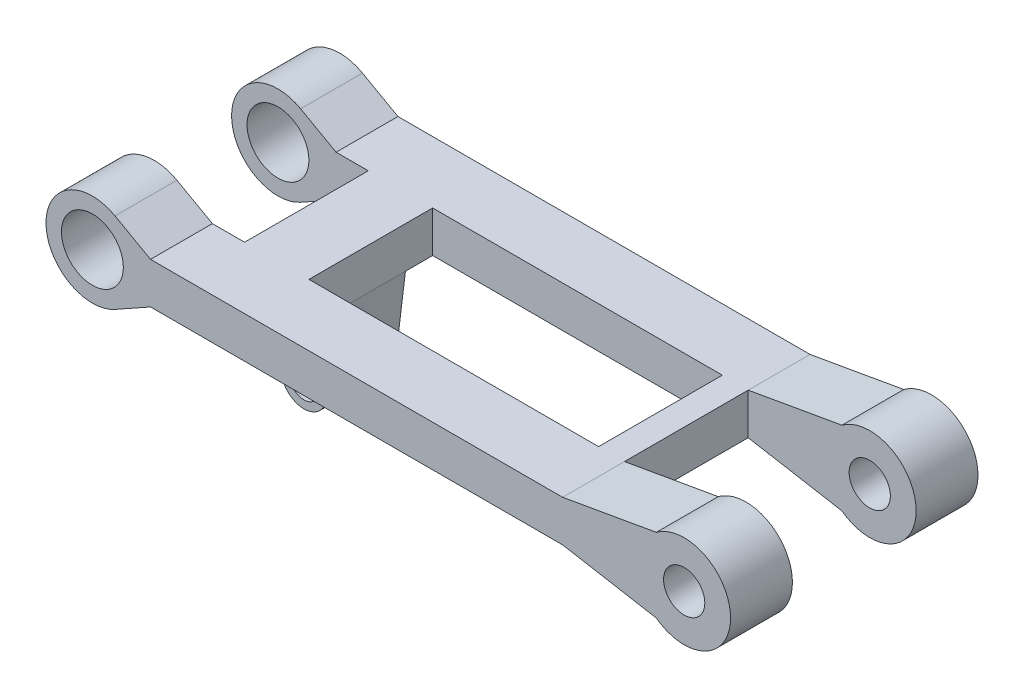
ISO-10303-21;
HEADER;
FILE_DESCRIPTION(('STEP AP214'),'2;1');
FILE_NAME('part.step','',(''),(''),'','','');
FILE_SCHEMA(('AUTOMOTIVE_DESIGN { 1 0 10303 214 1 1 1 1 }'));
ENDSEC;
DATA;
#1=APPLICATION_CONTEXT('core data for automotive mechanical design processes');
#2=APPLICATION_PROTOCOL_DEFINITION('international standard','automotive_design',2000,#1);
#3=PRODUCT_CONTEXT('',#1,'mechanical');
#4=PRODUCT('Part','Part','',(#3));
#5=PRODUCT_RELATED_PRODUCT_CATEGORY('part','',(#4));
#6=PRODUCT_DEFINITION_FORMATION('','',#4);
#7=PRODUCT_DEFINITION_CONTEXT('part definition',#1,'design');
#8=PRODUCT_DEFINITION('design','',#6,#7);
#9=PRODUCT_DEFINITION_SHAPE('','',#8);
#10=(LENGTH_UNIT() NAMED_UNIT(*) SI_UNIT(.MILLI.,.METRE.));
#11=(NAMED_UNIT(*) PLANE_ANGLE_UNIT() SI_UNIT($,.RADIAN.));
#12=(NAMED_UNIT(*) SI_UNIT($,.STERADIAN.) SOLID_ANGLE_UNIT());
#13=UNCERTAINTY_MEASURE_WITH_UNIT(LENGTH_MEASURE(1.E-05),#10,'distance_accuracy_value','');
#14=(GEOMETRIC_REPRESENTATION_CONTEXT(3) GLOBAL_UNCERTAINTY_ASSIGNED_CONTEXT((#13)) GLOBAL_UNIT_ASSIGNED_CONTEXT((#10,
#11,#12)) REPRESENTATION_CONTEXT('',''));
#15=CARTESIAN_POINT('',(0.,0.,0.));
#16=DIRECTION('',(0.,0.,1.));
#17=DIRECTION('',(1.,0.,0.));
#18=AXIS2_PLACEMENT_3D('',#15,#16,#17);
#19=CARTESIAN_POINT('',(0.546595673876796,3.10530127201074,120.));
#20=DIRECTION('',(0.17335512092089,0.98485938186652,0.));
#21=DIRECTION('',(-0.98485938186652,0.17335512092089,0.));
#22=AXIS2_PLACEMENT_3D('',#19,#20,#21);
#23=PLANE('',#22);
#24=DIRECTION('',(0.,0.,-1.));
#25=VECTOR('',#24,1.);
#26=CARTESIAN_POINT('',(120.453543603501,-18.0007407075051,120.));
#27=LINE('',#26,#25);
#28=CARTESIAN_POINT('',(120.453543603501,-18.0007407075051,30.));
#29=VERTEX_POINT('',#28);
#30=CARTESIAN_POINT('',(120.453543603501,-18.0007407075051,0.));
#31=VERTEX_POINT('',#30);
#32=EDGE_CURVE('E247',#29,#31,#27,.T.);
#33=ORIENTED_EDGE('',*,*,#32,.F.);
#34=DIRECTION('',(-0.98485938186652,0.17335512092089,0.));
#35=VECTOR('',#34,1.);
#36=CARTESIAN_POINT('',(0.546595673876781,3.10530127201074,30.));
#37=LINE('',#36,#35);
#38=CARTESIAN_POINT('',(75.,-9.99999999999999,30.));
#39=VERTEX_POINT('',#38);
#40=EDGE_CURVE('E240',#29,#39,#37,.T.);
#41=ORIENTED_EDGE('',*,*,#40,.T.);
#42=DIRECTION('',(0.,0.,-1.));
#43=VECTOR('',#42,1.);
#44=CARTESIAN_POINT('',(75.,-9.99999999999999,120.));
#45=LINE('',#44,#43);
#46=CARTESIAN_POINT('',(75.,-9.99999999999999,0.));
#47=VERTEX_POINT('',#46);
#48=EDGE_CURVE('E238',#39,#47,#45,.T.);
#49=ORIENTED_EDGE('',*,*,#48,.T.);
#50=DIRECTION('',(0.98485938186652,-0.17335512092089,0.));
#51=VECTOR('',#50,1.);
#52=CARTESIAN_POINT('',(0.546595673876796,3.10530127201074,0.));
#53=LINE('',#52,#51);
#54=EDGE_CURVE('E249',#47,#31,#53,.T.);
#55=ORIENTED_EDGE('',*,*,#54,.T.);
#56=EDGE_LOOP('',(#33,#41,#49,#55));
#57=FACE_BOUND('',#56,.T.);
#58=ADVANCED_FACE('F36',(#57),#23,.F.);
#59=CARTESIAN_POINT('',(133.952555937045,0.,120.));
#60=DIRECTION('',(0.,0.,-1.));
#61=DIRECTION('',(-1.,0.,0.));
#62=AXIS2_PLACEMENT_3D('',#59,#60,#61);
#63=CYLINDRICAL_SURFACE('',#62,22.5);
#64=DIRECTION('',(0.,0.,-1.));
#65=VECTOR('',#64,1.);
#66=CARTESIAN_POINT('',(120.453543603501,18.0007407075051,120.));
#67=LINE('',#66,#65);
#68=CARTESIAN_POINT('',(120.453543603501,18.0007407075051,30.));
#69=VERTEX_POINT('',#68);
#70=CARTESIAN_POINT('',(120.453543603501,18.0007407075051,0.));
#71=VERTEX_POINT('',#70);
#72=EDGE_CURVE('E261',#69,#71,#67,.T.);
#73=ORIENTED_EDGE('',*,*,#72,.F.);
#74=CARTESIAN_POINT('',(133.952555937045,0.,30.));
#75=DIRECTION('',(0.,0.,-1.));
#76=DIRECTION('',(-1.,0.,0.));
#77=AXIS2_PLACEMENT_3D('',#74,#75,#76);
#78=CIRCLE('',#77,22.5);
#79=EDGE_CURVE('E372',#69,#29,#78,.T.);
#80=ORIENTED_EDGE('',*,*,#79,.T.);
#81=ORIENTED_EDGE('',*,*,#32,.T.);
#82=CARTESIAN_POINT('',(133.952555937045,0.,0.));
#83=DIRECTION('',(0.,0.,1.));
#84=DIRECTION('',(1.,0.,0.));
#85=AXIS2_PLACEMENT_3D('',#82,#83,#84);
#86=CIRCLE('',#85,22.5);
#87=EDGE_CURVE('E244',#31,#71,#86,.T.);
#88=ORIENTED_EDGE('',*,*,#87,.T.);
#89=EDGE_LOOP('',(#73,#80,#81,#88));
#90=FACE_BOUND('',#89,.T.);
#91=ADVANCED_FACE('F540',(#90),#63,.T.);
#92=CARTESIAN_POINT('',(0.546595673876791,-3.10530127201071,120.));
#93=DIRECTION('',(-0.17335512092089,0.98485938186652,0.));
#94=DIRECTION('',(-0.98485938186652,-0.17335512092089,0.));
#95=AXIS2_PLACEMENT_3D('',#92,#93,#94);
#96=PLANE('',#95);
#97=DIRECTION('',(-0.98485938186652,-0.17335512092089,0.));
#98=VECTOR('',#97,1.);
#99=CARTESIAN_POINT('',(0.546595673876776,-3.10530127201071,30.));
#100=LINE('',#99,#98);
#101=CARTESIAN_POINT('',(75.,10.,30.));
#102=VERTEX_POINT('',#101);
#103=EDGE_CURVE('E370',#69,#102,#100,.T.);
#104=ORIENTED_EDGE('',*,*,#103,.F.);
#105=ORIENTED_EDGE('',*,*,#72,.T.);
#106=DIRECTION('',(0.98485938186652,0.17335512092089,0.));
#107=VECTOR('',#106,1.);
#108=CARTESIAN_POINT('',(0.546595673876791,-3.10530127201071,0.));
#109=LINE('',#108,#107);
#110=CARTESIAN_POINT('',(75.,10.,0.));
#111=VERTEX_POINT('',#110);
#112=EDGE_CURVE('E280',#111,#71,#109,.T.);
#113=ORIENTED_EDGE('',*,*,#112,.F.);
#114=DIRECTION('',(0.,0.,-1.));
#115=VECTOR('',#114,1.);
#116=CARTESIAN_POINT('',(75.,10.,120.));
#117=LINE('',#116,#115);
#118=EDGE_CURVE('E266',#102,#111,#117,.T.);
#119=ORIENTED_EDGE('',*,*,#118,.F.);
#120=EDGE_LOOP('',(#104,#105,#113,#119));
#121=FACE_BOUND('',#120,.T.);
#122=ADVANCED_FACE('F547',(#121),#96,.T.);
#123=CARTESIAN_POINT('',(133.952555937045,0.,120.));
#124=DIRECTION('',(0.,0.,-1.));
#125=DIRECTION('',(-1.,0.,0.));
#126=AXIS2_PLACEMENT_3D('',#123,#124,#125);
#127=CYLINDRICAL_SURFACE('',#126,9.99999999993476);
#128=CARTESIAN_POINT('',(133.952555937045,0.,30.));
#129=DIRECTION('',(0.,0.,-1.));
#130=DIRECTION('',(-1.,0.,0.));
#131=AXIS2_PLACEMENT_3D('',#128,#129,#130);
#132=CIRCLE('',#131,9.99999999993476);
#133=CARTESIAN_POINT('',(123.95255593711,0.,30.));
#134=VERTEX_POINT('',#133);
#135=EDGE_CURVE('E40',#134,#134,#132,.T.);
#136=ORIENTED_EDGE('',*,*,#135,.F.);
#137=EDGE_LOOP('',(#136));
#138=FACE_BOUND('',#137,.T.);
#139=CARTESIAN_POINT('',(133.952555937045,0.,0.));
#140=DIRECTION('',(0.,0.,1.));
#141=DIRECTION('',(1.,0.,0.));
#142=AXIS2_PLACEMENT_3D('',#139,#140,#141);
#143=CIRCLE('',#142,9.99999999993476);
#144=CARTESIAN_POINT('',(143.952555936979,0.,0.));
#145=VERTEX_POINT('',#144);
#146=EDGE_CURVE('E277',#145,#145,#143,.T.);
#147=ORIENTED_EDGE('',*,*,#146,.F.);
#148=EDGE_LOOP('',(#147));
#149=FACE_BOUND('',#148,.T.);
#150=ADVANCED_FACE('F584',(#138,#149),#127,.F.);
#151=CARTESIAN_POINT('',(0.,-35.,90.));
#152=DIRECTION('',(0.,0.,-1.));
#153=DIRECTION('',(-1.,0.,0.));
#154=AXIS2_PLACEMENT_3D('',#151,#152,#153);
#155=PLANE('',#154);
#156=CARTESIAN_POINT('',(-153.056371847261,0.,90.));
#157=DIRECTION('',(0.,0.,-1.));
#158=DIRECTION('',(-1.,0.,0.));
#159=AXIS2_PLACEMENT_3D('',#156,#157,#158);
#160=CIRCLE('',#159,15.);
#161=CARTESIAN_POINT('',(-168.056371847261,0.,90.));
#162=VERTEX_POINT('',#161);
#163=EDGE_CURVE('E289',#162,#162,#160,.T.);
#164=ORIENTED_EDGE('',*,*,#163,.F.);
#165=EDGE_LOOP('',(#164));
#166=FACE_BOUND('',#165,.T.);
#167=DIRECTION('',(-1.,0.,0.));
#168=VECTOR('',#167,1.);
#169=CARTESIAN_POINT('',(0.,9.99999999999999,90.));
#170=LINE('',#169,#168);
#171=CARTESIAN_POINT('',(-109.253854935079,9.99999999999998,90.));
#172=VERTEX_POINT('',#171);
#173=CARTESIAN_POINT('',(-124.863811460079,9.99999999999999,90.));
#174=VERTEX_POINT('',#173);
#175=EDGE_CURVE('E356',#172,#174,#170,.T.);
#176=ORIENTED_EDGE('',*,*,#175,.F.);
#177=DIRECTION('',(0.,1.,0.));
#178=VECTOR('',#177,1.);
#179=CARTESIAN_POINT('',(-109.253854935079,9.99999999999998,90.));
#180=LINE('',#179,#178);
#181=CARTESIAN_POINT('',(-109.253854935079,-9.99999999999999,90.));
#182=VERTEX_POINT('',#181);
#183=EDGE_CURVE('E382',#182,#172,#180,.T.);
#184=ORIENTED_EDGE('',*,*,#183,.F.);
#185=DIRECTION('',(-1.,0.,0.));
#186=VECTOR('',#185,1.);
#187=CARTESIAN_POINT('',(0.,-9.99999999999999,90.));
#188=LINE('',#187,#186);
#189=CARTESIAN_POINT('',(-124.863811460079,-9.99999999999999,90.));
#190=VERTEX_POINT('',#189);
#191=EDGE_CURVE('E340',#182,#190,#188,.T.);
#192=ORIENTED_EDGE('',*,*,#191,.T.);
#193=DIRECTION('',(0.872507010980212,0.488601592087434,0.));
#194=VECTOR('',#193,1.);
#195=CARTESIAN_POINT('',(-25.5458438305046,45.6177961850201,90.));
#196=LINE('',#195,#194);
#197=CARTESIAN_POINT('',(-142.062836025293,-19.6314077470548,90.));
#198=VERTEX_POINT('',#197);
#199=EDGE_CURVE('E322',#198,#190,#196,.T.);
#200=ORIENTED_EDGE('',*,*,#199,.F.);
#201=CARTESIAN_POINT('',(-153.056371847261,0.,90.));
#202=DIRECTION('',(0.,0.,-1.));
#203=DIRECTION('',(-1.,0.,0.));
#204=AXIS2_PLACEMENT_3D('',#201,#202,#203);
#205=CIRCLE('',#204,22.5);
#206=CARTESIAN_POINT('',(-142.062836025293,19.6314077470547,90.));
#207=VERTEX_POINT('',#206);
#208=EDGE_CURVE('E45',#198,#207,#205,.T.);
#209=ORIENTED_EDGE('',*,*,#208,.T.);
#210=DIRECTION('',(0.872507010980212,-0.488601592087435,0.));
#211=VECTOR('',#210,1.);
#212=CARTESIAN_POINT('',(-25.5458438305047,-45.6177961850201,90.));
#213=LINE('',#212,#211);
#214=EDGE_CURVE('E12',#207,#174,#213,.T.);
#215=ORIENTED_EDGE('',*,*,#214,.T.);
#216=EDGE_LOOP('',(#176,#184,#192,#200,#209,#215));
#217=FACE_BOUND('',#216,.T.);
#218=ADVANCED_FACE('F482',(#166,#217),#155,.T.);
#219=CARTESIAN_POINT('',(62.442395770289,-10.,90.));
#220=VERTEX_POINT('',#219);
#221=CARTESIAN_POINT('',(-78.0339418850794,-9.99999999999999,90.));
#222=VERTEX_POINT('',#221);
#223=EDGE_CURVE('E347',#220,#222,#188,.T.);
#224=ORIENTED_EDGE('',*,*,#223,.T.);
#225=DIRECTION('',(0.,-1.,0.));
#226=VECTOR('',#225,1.);
#227=CARTESIAN_POINT('',(-78.0339418850794,9.99999999999998,90.));
#228=LINE('',#227,#226);
#229=CARTESIAN_POINT('',(-78.0339418850794,9.99999999999998,90.));
#230=VERTEX_POINT('',#229);
#231=EDGE_CURVE('E239',#230,#222,#228,.T.);
#232=ORIENTED_EDGE('',*,*,#231,.F.);
#233=CARTESIAN_POINT('',(62.442395770289,9.99999999999997,90.));
#234=VERTEX_POINT('',#233);
#235=EDGE_CURVE('E310',#234,#230,#170,.T.);
#236=ORIENTED_EDGE('',*,*,#235,.F.);
#237=DIRECTION('',(0.,1.,0.));
#238=VECTOR('',#237,1.);
#239=CARTESIAN_POINT('',(62.442395770289,-35.,90.));
#240=LINE('',#239,#238);
#241=EDGE_CURVE('E328',#220,#234,#240,.T.);
#242=ORIENTED_EDGE('',*,*,#241,.F.);
#243=EDGE_LOOP('',(#224,#232,#236,#242));
#244=FACE_BOUND('',#243,.T.);
#245=ADVANCED_FACE('F515',(#244),#155,.T.);
#246=CARTESIAN_POINT('',(-117.557604229711,0.,76.8));
#247=DIRECTION('',(0.,0.,1.));
#248=DIRECTION('',(1.,0.,0.));
#249=AXIS2_PLACEMENT_3D('',#246,#247,#248);
#250=PLANE('',#249);
#251=CARTESIAN_POINT('',(-93.6438984100794,-47.8166351,76.8));
#252=DIRECTION('',(0.,0.,1.));
#253=DIRECTION('',(1.,0.,0.));
#254=AXIS2_PLACEMENT_3D('',#251,#252,#253);
#255=CIRCLE('',#254,7.2);
#256=CARTESIAN_POINT('',(-86.4438984100794,-47.8166351,76.8));
#257=VERTEX_POINT('',#256);
#258=EDGE_CURVE('E379',#257,#257,#255,.F.);
#259=ORIENTED_EDGE('',*,*,#258,.T.);
#260=EDGE_LOOP('',(#259));
#261=FACE_BOUND('',#260,.T.);
#262=DIRECTION('',(0.121007088729422,0.992651643063784,0.));
#263=VECTOR('',#262,1.);
#264=CARTESIAN_POINT('',(-75.6901342184396,9.226844937307,76.8));
#265=LINE('',#264,#263);
#266=CARTESIAN_POINT('',(-82.6438984100794,-47.8166351,76.8));
#267=VERTEX_POINT('',#266);
#268=CARTESIAN_POINT('',(-78.0339418850794,-9.99999999999999,76.8));
#269=VERTEX_POINT('',#268);
#270=EDGE_CURVE('E393',#267,#269,#265,.T.);
#271=ORIENTED_EDGE('',*,*,#270,.T.);
#272=DIRECTION('',(1.,0.,0.));
#273=VECTOR('',#272,1.);
#274=CARTESIAN_POINT('',(-78.0339418850795,-9.99999999999999,76.8));
#275=LINE('',#274,#273);
#276=CARTESIAN_POINT('',(-109.253854935079,-9.99999999999999,76.8));
#277=VERTEX_POINT('',#276);
#278=EDGE_CURVE('E377',#277,#269,#275,.T.);
#279=ORIENTED_EDGE('',*,*,#278,.F.);
#280=DIRECTION('',(0.121007088729422,-0.992651643063784,0.));
#281=VECTOR('',#280,1.);
#282=CARTESIAN_POINT('',(-108.855260671995,-13.2697691872496,76.8));
#283=LINE('',#282,#281);
#284=CARTESIAN_POINT('',(-104.643898410079,-47.8166351,76.8));
#285=VERTEX_POINT('',#284);
#286=EDGE_CURVE('E388',#277,#285,#283,.T.);
#287=ORIENTED_EDGE('',*,*,#286,.T.);
#288=CARTESIAN_POINT('',(-93.6438984100794,-47.8166351,76.8));
#289=DIRECTION('',(0.,0.,1.));
#290=DIRECTION('',(1.,0.,0.));
#291=AXIS2_PLACEMENT_3D('',#288,#289,#290);
#292=CIRCLE('',#291,11.);
#293=EDGE_CURVE('E391',#267,#285,#292,.F.);
#294=ORIENTED_EDGE('',*,*,#293,.F.);
#295=EDGE_LOOP('',(#271,#279,#287,#294));
#296=FACE_BOUND('',#295,.T.);
#297=ADVANCED_FACE('F497',(#261,#296),#250,.T.);
#298=CARTESIAN_POINT('',(0.,-35.,30.));
#299=DIRECTION('',(0.,0.,1.));
#300=DIRECTION('',(1.,0.,0.));
#301=AXIS2_PLACEMENT_3D('',#298,#299,#300);
#302=PLANE('',#301);
#303=CARTESIAN_POINT('',(-153.056371847261,0.,30.));
#304=DIRECTION('',(0.,0.,1.));
#305=DIRECTION('',(1.,0.,0.));
#306=AXIS2_PLACEMENT_3D('',#303,#304,#305);
#307=CIRCLE('',#306,15.);
#308=CARTESIAN_POINT('',(-138.056371847261,0.,30.));
#309=VERTEX_POINT('',#308);
#310=EDGE_CURVE('E265',#309,#309,#307,.T.);
#311=ORIENTED_EDGE('',*,*,#310,.F.);
#312=EDGE_LOOP('',(#311));
#313=FACE_BOUND('',#312,.T.);
#314=DIRECTION('',(1.,0.,0.));
#315=VECTOR('',#314,1.);
#316=CARTESIAN_POINT('',(0.,-9.99999999999999,30.));
#317=LINE('',#316,#315);
#318=CARTESIAN_POINT('',(-124.863811460079,-9.99999999999999,30.));
#319=VERTEX_POINT('',#318);
#320=CARTESIAN_POINT('',(-109.253854935079,-9.99999999999999,30.));
#321=VERTEX_POINT('',#320);
#322=EDGE_CURVE('E329',#319,#321,#317,.T.);
#323=ORIENTED_EDGE('',*,*,#322,.T.);
#324=DIRECTION('',(0.,-1.,0.));
#325=VECTOR('',#324,1.);
#326=CARTESIAN_POINT('',(-109.253854935079,9.99999999999997,30.));
#327=LINE('',#326,#325);
#328=CARTESIAN_POINT('',(-109.253854935079,9.99999999999998,30.));
#329=VERTEX_POINT('',#328);
#330=EDGE_CURVE('E422',#329,#321,#327,.T.);
#331=ORIENTED_EDGE('',*,*,#330,.F.);
#332=DIRECTION('',(1.,0.,0.));
#333=VECTOR('',#332,1.);
#334=CARTESIAN_POINT('',(0.,9.99999999999999,30.));
#335=LINE('',#334,#333);
#336=CARTESIAN_POINT('',(-124.863811460079,9.99999999999997,30.));
#337=VERTEX_POINT('',#336);
#338=EDGE_CURVE('E343',#337,#329,#335,.T.);
#339=ORIENTED_EDGE('',*,*,#338,.F.);
#340=DIRECTION('',(-0.872507010980212,0.488601592087435,0.));
#341=VECTOR('',#340,1.);
#342=CARTESIAN_POINT('',(-25.5458438305047,-45.6177961850201,30.));
#343=LINE('',#342,#341);
#344=CARTESIAN_POINT('',(-142.062836025293,19.6314077470547,30.));
#345=VERTEX_POINT('',#344);
#346=EDGE_CURVE('E341',#337,#345,#343,.T.);
#347=ORIENTED_EDGE('',*,*,#346,.T.);
#348=CARTESIAN_POINT('',(-153.056371847261,0.,30.));
#349=DIRECTION('',(0.,0.,1.));
#350=DIRECTION('',(1.,0.,0.));
#351=AXIS2_PLACEMENT_3D('',#348,#349,#350);
#352=CIRCLE('',#351,22.5);
#353=CARTESIAN_POINT('',(-142.062836025293,-19.6314077470548,30.));
#354=VERTEX_POINT('',#353);
#355=EDGE_CURVE('E338',#345,#354,#352,.T.);
#356=ORIENTED_EDGE('',*,*,#355,.T.);
#357=DIRECTION('',(-0.872507010980212,-0.488601592087434,0.));
#358=VECTOR('',#357,1.);
#359=CARTESIAN_POINT('',(-25.5458438305046,45.6177961850201,30.));
#360=LINE('',#359,#358);
#361=EDGE_CURVE('E334',#319,#354,#360,.T.);
#362=ORIENTED_EDGE('',*,*,#361,.F.);
#363=EDGE_LOOP('',(#323,#331,#339,#347,#356,#362));
#364=FACE_BOUND('',#363,.T.);
#365=ADVANCED_FACE('F580',(#313,#364),#302,.T.);
#366=CARTESIAN_POINT('',(-78.0339418850794,9.99999999999998,30.));
#367=VERTEX_POINT('',#366);
#368=CARTESIAN_POINT('',(62.442395770289,9.99999999999999,30.));
#369=VERTEX_POINT('',#368);
#370=EDGE_CURVE('E321',#367,#369,#335,.T.);
#371=ORIENTED_EDGE('',*,*,#370,.F.);
#372=DIRECTION('',(0.,1.,0.));
#373=VECTOR('',#372,1.);
#374=CARTESIAN_POINT('',(-78.0339418850794,9.99999999999997,30.));
#375=LINE('',#374,#373);
#376=CARTESIAN_POINT('',(-78.0339418850794,-9.99999999999999,30.));
#377=VERTEX_POINT('',#376);
#378=EDGE_CURVE('E293',#377,#367,#375,.T.);
#379=ORIENTED_EDGE('',*,*,#378,.F.);
#380=CARTESIAN_POINT('',(62.442395770289,-10.,30.));
#381=VERTEX_POINT('',#380);
#382=EDGE_CURVE('E333',#377,#381,#317,.T.);
#383=ORIENTED_EDGE('',*,*,#382,.T.);
#384=DIRECTION('',(0.,1.,0.));
#385=VECTOR('',#384,1.);
#386=CARTESIAN_POINT('',(62.442395770289,-35.,30.));
#387=LINE('',#386,#385);
#388=EDGE_CURVE('E332',#381,#369,#387,.T.);
#389=ORIENTED_EDGE('',*,*,#388,.T.);
#390=EDGE_LOOP('',(#371,#379,#383,#389));
#391=FACE_BOUND('',#390,.T.);
#392=ADVANCED_FACE('F522',(#391),#302,.T.);
#393=CARTESIAN_POINT('',(0.,-9.99999999999999,120.));
#394=DIRECTION('',(0.,1.,0.));
#395=DIRECTION('',(0.,0.,1.));
#396=AXIS2_PLACEMENT_3D('',#393,#394,#395);
#397=PLANE('',#396);
#398=DIRECTION('',(0.,0.,1.));
#399=VECTOR('',#398,1.);
#400=CARTESIAN_POINT('',(62.442395770289,-9.99999999999999,120.));
#401=LINE('',#400,#399);
#402=EDGE_CURVE('E276',#381,#220,#401,.T.);
#403=ORIENTED_EDGE('',*,*,#402,.F.);
#404=ORIENTED_EDGE('',*,*,#382,.F.);
#405=DIRECTION('',(0.,0.,1.));
#406=VECTOR('',#405,1.);
#407=CARTESIAN_POINT('',(-78.0339418850794,-9.99999999999999,-7.07671736884969));
#408=LINE('',#407,#406);
#409=CARTESIAN_POINT('',(-78.0339418850794,-9.99999999999999,43.2));
#410=VERTEX_POINT('',#409);
#411=EDGE_CURVE('E425',#377,#410,#408,.T.);
#412=ORIENTED_EDGE('',*,*,#411,.T.);
#413=DIRECTION('',(-1.,0.,0.));
#414=VECTOR('',#413,1.);
#415=CARTESIAN_POINT('',(-78.0339418850794,-9.99999999999999,43.2));
#416=LINE('',#415,#414);
#417=CARTESIAN_POINT('',(-109.253854935079,-10.,43.2));
#418=VERTEX_POINT('',#417);
#419=EDGE_CURVE('E409',#410,#418,#416,.T.);
#420=ORIENTED_EDGE('',*,*,#419,.T.);
#421=DIRECTION('',(0.,0.,1.));
#422=VECTOR('',#421,1.);
#423=CARTESIAN_POINT('',(-109.253854935079,-9.99999999999999,-7.07671736884969));
#424=LINE('',#423,#422);
#425=EDGE_CURVE('E432',#321,#418,#424,.T.);
#426=ORIENTED_EDGE('',*,*,#425,.F.);
#427=ORIENTED_EDGE('',*,*,#322,.F.);
#428=DIRECTION('',(0.,0.,-1.));
#429=VECTOR('',#428,1.);
#430=CARTESIAN_POINT('',(-124.863811460079,-9.99999999999999,120.));
#431=LINE('',#430,#429);
#432=CARTESIAN_POINT('',(-124.863811460079,-9.99999999999999,0.));
#433=VERTEX_POINT('',#432);
#434=EDGE_CURVE('E465',#319,#433,#431,.T.);
#435=ORIENTED_EDGE('',*,*,#434,.T.);
#436=DIRECTION('',(1.,0.,0.));
#437=VECTOR('',#436,1.);
#438=CARTESIAN_POINT('',(0.,-9.99999999999999,0.));
#439=LINE('',#438,#437);
#440=EDGE_CURVE('E290',#433,#47,#439,.T.);
#441=ORIENTED_EDGE('',*,*,#440,.T.);
#442=ORIENTED_EDGE('',*,*,#48,.F.);
#443=DIRECTION('',(0.,0.,-1.));
#444=VECTOR('',#443,1.);
#445=CARTESIAN_POINT('',(75.,-9.99999999999999,120.));
#446=LINE('',#445,#444);
#447=CARTESIAN_POINT('',(75.,-9.99999999999999,90.));
#448=VERTEX_POINT('',#447);
#449=EDGE_CURVE('E223',#448,#39,#446,.T.);
#450=ORIENTED_EDGE('',*,*,#449,.F.);
#451=CARTESIAN_POINT('',(75.,-9.99999999999999,120.));
#452=VERTEX_POINT('',#451);
#453=EDGE_CURVE('E235',#452,#448,#45,.T.);
#454=ORIENTED_EDGE('',*,*,#453,.F.);
#455=DIRECTION('',(1.,0.,0.));
#456=VECTOR('',#455,1.);
#457=CARTESIAN_POINT('',(0.,-9.99999999999999,120.));
#458=LINE('',#457,#456);
#459=CARTESIAN_POINT('',(-124.863811460079,-9.99999999999999,120.));
#460=VERTEX_POINT('',#459);
#461=EDGE_CURVE('E292',#460,#452,#458,.T.);
#462=ORIENTED_EDGE('',*,*,#461,.F.);
#463=EDGE_CURVE('E252',#460,#190,#431,.T.);
#464=ORIENTED_EDGE('',*,*,#463,.T.);
#465=ORIENTED_EDGE('',*,*,#191,.F.);
#466=DIRECTION('',(0.,0.,1.));
#467=VECTOR('',#466,1.);
#468=CARTESIAN_POINT('',(-109.253854935079,-9.99999999999999,39.7232826311503));
#469=LINE('',#468,#467);
#470=EDGE_CURVE('E385',#277,#182,#469,.T.);
#471=ORIENTED_EDGE('',*,*,#470,.F.);
#472=ORIENTED_EDGE('',*,*,#278,.T.);
#473=DIRECTION('',(0.,0.,1.));
#474=VECTOR('',#473,1.);
#475=CARTESIAN_POINT('',(-78.0339418850795,-9.99999999999999,39.7232826311503));
#476=LINE('',#475,#474);
#477=EDGE_CURVE('E380',#269,#222,#476,.T.);
#478=ORIENTED_EDGE('',*,*,#477,.T.);
#479=ORIENTED_EDGE('',*,*,#223,.F.);
#480=EDGE_LOOP('',(#403,#404,#412,#420,#426,#427,#435,#441,#442,#450,#454,#462,#464,#465,#471,
#472,#478,#479));
#481=FACE_BOUND('',#480,.T.);
#482=ADVANCED_FACE('F234',(#481),#397,.F.);
#483=CARTESIAN_POINT('',(0.,0.,120.));
#484=DIRECTION('',(0.,0.,1.));
#485=DIRECTION('',(1.,0.,0.));
#486=AXIS2_PLACEMENT_3D('',#483,#484,#485);
#487=PLANE('',#486);
#488=CARTESIAN_POINT('',(-153.056371847261,0.,120.));
#489=DIRECTION('',(0.,0.,1.));
#490=DIRECTION('',(1.,0.,0.));
#491=AXIS2_PLACEMENT_3D('',#488,#489,#490);
#492=CIRCLE('',#491,15.);
#493=CARTESIAN_POINT('',(-138.056371847261,0.,120.));
#494=VERTEX_POINT('',#493);
#495=EDGE_CURVE('E302',#494,#494,#492,.T.);
#496=ORIENTED_EDGE('',*,*,#495,.F.);
#497=EDGE_LOOP('',(#496));
#498=FACE_BOUND('',#497,.T.);
#499=CARTESIAN_POINT('',(133.952555937045,0.,120.));
#500=DIRECTION('',(0.,0.,1.));
#501=DIRECTION('',(1.,0.,0.));
#502=AXIS2_PLACEMENT_3D('',#499,#500,#501);
#503=CIRCLE('',#502,9.99999999993476);
#504=CARTESIAN_POINT('',(143.952555936979,0.,120.));
#505=VERTEX_POINT('',#504);
#506=EDGE_CURVE('E260',#505,#505,#503,.T.);
#507=ORIENTED_EDGE('',*,*,#506,.F.);
#508=EDGE_LOOP('',(#507));
#509=FACE_BOUND('',#508,.T.);
#510=ORIENTED_EDGE('',*,*,#461,.T.);
#511=DIRECTION('',(0.98485938186652,-0.17335512092089,0.));
#512=VECTOR('',#511,1.);
#513=CARTESIAN_POINT('',(0.546595673876796,3.10530127201074,120.));
#514=LINE('',#513,#512);
#515=CARTESIAN_POINT('',(120.453543603501,-18.0007407075051,120.));
#516=VERTEX_POINT('',#515);
#517=EDGE_CURVE('E243',#452,#516,#514,.T.);
#518=ORIENTED_EDGE('',*,*,#517,.T.);
#519=CARTESIAN_POINT('',(133.952555937045,0.,120.));
#520=DIRECTION('',(0.,0.,1.));
#521=DIRECTION('',(1.,0.,0.));
#522=AXIS2_PLACEMENT_3D('',#519,#520,#521);
#523=CIRCLE('',#522,22.5);
#524=CARTESIAN_POINT('',(120.453543603501,18.0007407075051,120.));
#525=VERTEX_POINT('',#524);
#526=EDGE_CURVE('E313',#516,#525,#523,.T.);
#527=ORIENTED_EDGE('',*,*,#526,.T.);
#528=DIRECTION('',(0.98485938186652,0.17335512092089,0.));
#529=VECTOR('',#528,1.);
#530=CARTESIAN_POINT('',(0.546595673876791,-3.10530127201071,120.));
#531=LINE('',#530,#529);
#532=CARTESIAN_POINT('',(75.,10.,120.));
#533=VERTEX_POINT('',#532);
#534=EDGE_CURVE('E256',#533,#525,#531,.T.);
#535=ORIENTED_EDGE('',*,*,#534,.F.);
#536=DIRECTION('',(1.,0.,0.));
#537=VECTOR('',#536,1.);
#538=CARTESIAN_POINT('',(0.,9.99999999999999,120.));
#539=LINE('',#538,#537);
#540=CARTESIAN_POINT('',(-124.863811460079,9.99999999999999,120.));
#541=VERTEX_POINT('',#540);
#542=EDGE_CURVE('E307',#541,#533,#539,.T.);
#543=ORIENTED_EDGE('',*,*,#542,.F.);
#544=DIRECTION('',(-0.872507010980212,0.488601592087435,0.));
#545=VECTOR('',#544,1.);
#546=CARTESIAN_POINT('',(-25.5458438305047,-45.6177961850201,120.));
#547=LINE('',#546,#545);
#548=CARTESIAN_POINT('',(-142.062836025293,19.6314077470547,120.));
#549=VERTEX_POINT('',#548);
#550=EDGE_CURVE('E315',#541,#549,#547,.T.);
#551=ORIENTED_EDGE('',*,*,#550,.T.);
#552=CARTESIAN_POINT('',(-153.056371847261,0.,120.));
#553=DIRECTION('',(0.,0.,1.));
#554=DIRECTION('',(1.,0.,0.));
#555=AXIS2_PLACEMENT_3D('',#552,#553,#554);
#556=CIRCLE('',#555,22.5);
#557=CARTESIAN_POINT('',(-142.062836025293,-19.6314077470548,120.));
#558=VERTEX_POINT('',#557);
#559=EDGE_CURVE('E323',#549,#558,#556,.T.);
#560=ORIENTED_EDGE('',*,*,#559,.T.);
#561=DIRECTION('',(-0.872507010980212,-0.488601592087434,0.));
#562=VECTOR('',#561,1.);
#563=CARTESIAN_POINT('',(-25.5458438305046,45.6177961850201,120.));
#564=LINE('',#563,#562);
#565=EDGE_CURVE('E318',#460,#558,#564,.T.);
#566=ORIENTED_EDGE('',*,*,#565,.F.);
#567=EDGE_LOOP('',(#510,#518,#527,#535,#543,#551,#560,#566));
#568=FACE_BOUND('',#567,.T.);
#569=ADVANCED_FACE('F472',(#498,#509,#568),#487,.T.);
#570=CARTESIAN_POINT('',(-25.5458438305047,-45.6177961850201,120.));
#571=DIRECTION('',(-0.488601592087435,-0.872507010980212,0.));
#572=DIRECTION('',(0.872507010980212,-0.488601592087435,0.));
#573=AXIS2_PLACEMENT_3D('',#570,#571,#572);
#574=PLANE('',#573);
#575=ORIENTED_EDGE('',*,*,#346,.F.);
#576=DIRECTION('',(0.,0.,-1.));
#577=VECTOR('',#576,1.);
#578=CARTESIAN_POINT('',(-124.863811460079,9.99999999999999,120.));
#579=LINE('',#578,#577);
#580=CARTESIAN_POINT('',(-124.863811460079,9.99999999999999,0.));
#581=VERTEX_POINT('',#580);
#582=EDGE_CURVE('E272',#337,#581,#579,.T.);
#583=ORIENTED_EDGE('',*,*,#582,.T.);
#584=DIRECTION('',(-0.872507010980212,0.488601592087435,0.));
#585=VECTOR('',#584,1.);
#586=CARTESIAN_POINT('',(-25.5458438305047,-45.6177961850201,0.));
#587=LINE('',#586,#585);
#588=CARTESIAN_POINT('',(-142.062836025293,19.6314077470547,0.));
#589=VERTEX_POINT('',#588);
#590=EDGE_CURVE('E271',#581,#589,#587,.T.);
#591=ORIENTED_EDGE('',*,*,#590,.T.);
#592=DIRECTION('',(0.,0.,-1.));
#593=VECTOR('',#592,1.);
#594=CARTESIAN_POINT('',(-142.062836025293,19.6314077470547,120.));
#595=LINE('',#594,#593);
#596=EDGE_CURVE('E270',#345,#589,#595,.T.);
#597=ORIENTED_EDGE('',*,*,#596,.F.);
#598=EDGE_LOOP('',(#575,#583,#591,#597));
#599=FACE_BOUND('',#598,.T.);
#600=ADVANCED_FACE('F578',(#599),#574,.F.);
#601=ORIENTED_EDGE('',*,*,#214,.F.);
#602=EDGE_CURVE('E299',#549,#207,#595,.T.);
#603=ORIENTED_EDGE('',*,*,#602,.F.);
#604=ORIENTED_EDGE('',*,*,#550,.F.);
#605=EDGE_CURVE('E267',#541,#174,#579,.T.);
#606=ORIENTED_EDGE('',*,*,#605,.T.);
#607=EDGE_LOOP('',(#601,#603,#604,#606));
#608=FACE_BOUND('',#607,.T.);
#609=ADVANCED_FACE('F484',(#608),#574,.F.);
#610=CARTESIAN_POINT('',(-153.056371847261,0.,120.));
#611=DIRECTION('',(0.,0.,-1.));
#612=DIRECTION('',(-1.,0.,0.));
#613=AXIS2_PLACEMENT_3D('',#610,#611,#612);
#614=CYLINDRICAL_SURFACE('',#613,22.5);
#615=ORIENTED_EDGE('',*,*,#355,.F.);
#616=ORIENTED_EDGE('',*,*,#596,.T.);
#617=CARTESIAN_POINT('',(-153.056371847261,0.,0.));
#618=DIRECTION('',(0.,0.,1.));
#619=DIRECTION('',(1.,0.,0.));
#620=AXIS2_PLACEMENT_3D('',#617,#618,#619);
#621=CIRCLE('',#620,22.5);
#622=CARTESIAN_POINT('',(-142.062836025293,-19.6314077470548,0.));
#623=VERTEX_POINT('',#622);
#624=EDGE_CURVE('E296',#589,#623,#621,.T.);
#625=ORIENTED_EDGE('',*,*,#624,.T.);
#626=DIRECTION('',(0.,0.,-1.));
#627=VECTOR('',#626,1.);
#628=CARTESIAN_POINT('',(-142.062836025293,-19.6314077470548,120.));
#629=LINE('',#628,#627);
#630=EDGE_CURVE('E337',#354,#623,#629,.T.);
#631=ORIENTED_EDGE('',*,*,#630,.F.);
#632=EDGE_LOOP('',(#615,#616,#625,#631));
#633=FACE_BOUND('',#632,.T.);
#634=ADVANCED_FACE('F455',(#633),#614,.T.);
#635=ORIENTED_EDGE('',*,*,#208,.F.);
#636=EDGE_CURVE('E352',#558,#198,#629,.T.);
#637=ORIENTED_EDGE('',*,*,#636,.F.);
#638=ORIENTED_EDGE('',*,*,#559,.F.);
#639=ORIENTED_EDGE('',*,*,#602,.T.);
#640=EDGE_LOOP('',(#635,#637,#638,#639));
#641=FACE_BOUND('',#640,.T.);
#642=ADVANCED_FACE('F478',(#641),#614,.T.);
#643=CARTESIAN_POINT('',(-25.5458438305046,45.6177961850201,120.));
#644=DIRECTION('',(0.488601592087434,-0.872507010980212,0.));
#645=DIRECTION('',(0.872507010980213,0.488601592087434,0.));
#646=AXIS2_PLACEMENT_3D('',#643,#644,#645);
#647=PLANE('',#646);
#648=ORIENTED_EDGE('',*,*,#434,.F.);
#649=ORIENTED_EDGE('',*,*,#361,.T.);
#650=ORIENTED_EDGE('',*,*,#630,.T.);
#651=DIRECTION('',(-0.872507010980212,-0.488601592087434,0.));
#652=VECTOR('',#651,1.);
#653=CARTESIAN_POINT('',(-25.5458438305046,45.6177961850201,0.));
#654=LINE('',#653,#652);
#655=EDGE_CURVE('E284',#433,#623,#654,.T.);
#656=ORIENTED_EDGE('',*,*,#655,.F.);
#657=EDGE_LOOP('',(#648,#649,#650,#656));
#658=FACE_BOUND('',#657,.T.);
#659=ADVANCED_FACE('F451',(#658),#647,.T.);
#660=ORIENTED_EDGE('',*,*,#636,.T.);
#661=ORIENTED_EDGE('',*,*,#199,.T.);
#662=ORIENTED_EDGE('',*,*,#463,.F.);
#663=ORIENTED_EDGE('',*,*,#565,.T.);
#664=EDGE_LOOP('',(#660,#661,#662,#663));
#665=FACE_BOUND('',#664,.T.);
#666=ADVANCED_FACE('F470',(#665),#647,.T.);
#667=CARTESIAN_POINT('',(0.,9.99999999999999,120.));
#668=DIRECTION('',(0.,1.,0.));
#669=DIRECTION('',(-1.,0.,0.));
#670=AXIS2_PLACEMENT_3D('',#667,#668,#669);
#671=PLANE('',#670);
#672=ORIENTED_EDGE('',*,*,#235,.T.);
#673=DIRECTION('',(0.,0.,1.));
#674=VECTOR('',#673,1.);
#675=CARTESIAN_POINT('',(-78.0339418850794,9.99999999999997,-7.07671736884969));
#676=LINE('',#675,#674);
#677=EDGE_CURVE('E61',#367,#230,#676,.T.);
#678=ORIENTED_EDGE('',*,*,#677,.F.);
#679=ORIENTED_EDGE('',*,*,#370,.T.);
#680=DIRECTION('',(0.,0.,1.));
#681=VECTOR('',#680,1.);
#682=CARTESIAN_POINT('',(62.442395770289,10.,120.));
#683=LINE('',#682,#681);
#684=EDGE_CURVE('E346',#369,#234,#683,.T.);
#685=ORIENTED_EDGE('',*,*,#684,.T.);
#686=EDGE_LOOP('',(#672,#678,#679,#685));
#687=FACE_BOUND('',#686,.T.);
#688=ORIENTED_EDGE('',*,*,#582,.F.);
#689=ORIENTED_EDGE('',*,*,#338,.T.);
#690=DIRECTION('',(0.,0.,1.));
#691=VECTOR('',#690,1.);
#692=CARTESIAN_POINT('',(-109.253854935079,9.99999999999997,-7.07671736884969));
#693=LINE('',#692,#691);
#694=EDGE_CURVE('E430',#329,#172,#693,.T.);
#695=ORIENTED_EDGE('',*,*,#694,.T.);
#696=ORIENTED_EDGE('',*,*,#175,.T.);
#697=ORIENTED_EDGE('',*,*,#605,.F.);
#698=ORIENTED_EDGE('',*,*,#542,.T.);
#699=CARTESIAN_POINT('',(75.,10.,90.));
#700=VERTEX_POINT('',#699);
#701=EDGE_CURVE('E262',#533,#700,#117,.T.);
#702=ORIENTED_EDGE('',*,*,#701,.T.);
#703=EDGE_CURVE('E226',#700,#102,#117,.T.);
#704=ORIENTED_EDGE('',*,*,#703,.T.);
#705=ORIENTED_EDGE('',*,*,#118,.T.);
#706=DIRECTION('',(1.,0.,0.));
#707=VECTOR('',#706,1.);
#708=CARTESIAN_POINT('',(0.,9.99999999999999,0.));
#709=LINE('',#708,#707);
#710=EDGE_CURVE('E281',#581,#111,#709,.T.);
#711=ORIENTED_EDGE('',*,*,#710,.F.);
#712=EDGE_LOOP('',(#688,#689,#695,#696,#697,#698,#702,#704,#705,#711));
#713=FACE_BOUND('',#712,.T.);
#714=ADVANCED_FACE('F487',(#687,#713),#671,.T.);
#715=CARTESIAN_POINT('',(-153.056371847261,0.,120.));
#716=DIRECTION('',(0.,0.,-1.));
#717=DIRECTION('',(-1.,0.,0.));
#718=AXIS2_PLACEMENT_3D('',#715,#716,#717);
#719=CYLINDRICAL_SURFACE('',#718,15.);
#720=CARTESIAN_POINT('',(-153.056371847261,0.,0.));
#721=DIRECTION('',(0.,0.,1.));
#722=DIRECTION('',(1.,0.,0.));
#723=AXIS2_PLACEMENT_3D('',#720,#721,#722);
#724=CIRCLE('',#723,15.);
#725=CARTESIAN_POINT('',(-138.056371847261,0.,0.));
#726=VERTEX_POINT('',#725);
#727=EDGE_CURVE('E273',#726,#726,#724,.T.);
#728=ORIENTED_EDGE('',*,*,#727,.F.);
#729=EDGE_LOOP('',(#728));
#730=FACE_BOUND('',#729,.T.);
#731=ORIENTED_EDGE('',*,*,#310,.T.);
#732=EDGE_LOOP('',(#731));
#733=FACE_BOUND('',#732,.T.);
#734=ADVANCED_FACE('F562',(#730,#733),#719,.F.);
#735=ORIENTED_EDGE('',*,*,#495,.T.);
#736=EDGE_LOOP('',(#735));
#737=FACE_BOUND('',#736,.T.);
#738=ORIENTED_EDGE('',*,*,#163,.T.);
#739=EDGE_LOOP('',(#738));
#740=FACE_BOUND('',#739,.T.);
#741=ADVANCED_FACE('F554',(#737,#740),#719,.F.);
#742=ORIENTED_EDGE('',*,*,#453,.T.);
#743=DIRECTION('',(0.98485938186652,-0.17335512092089,0.));
#744=VECTOR('',#743,1.);
#745=CARTESIAN_POINT('',(0.546595673876796,3.10530127201074,90.));
#746=LINE('',#745,#744);
#747=CARTESIAN_POINT('',(120.453543603501,-18.0007407075051,90.));
#748=VERTEX_POINT('',#747);
#749=EDGE_CURVE('E211',#448,#748,#746,.T.);
#750=ORIENTED_EDGE('',*,*,#749,.T.);
#751=EDGE_CURVE('E254',#516,#748,#27,.T.);
#752=ORIENTED_EDGE('',*,*,#751,.F.);
#753=ORIENTED_EDGE('',*,*,#517,.F.);
#754=EDGE_LOOP('',(#742,#750,#752,#753));
#755=FACE_BOUND('',#754,.T.);
#756=ADVANCED_FACE('F242',(#755),#23,.F.);
#757=CARTESIAN_POINT('',(133.952555937045,0.,90.));
#758=DIRECTION('',(0.,0.,1.));
#759=DIRECTION('',(1.,0.,0.));
#760=AXIS2_PLACEMENT_3D('',#757,#758,#759);
#761=CIRCLE('',#760,22.5);
#762=CARTESIAN_POINT('',(120.453543603501,18.0007407075051,90.));
#763=VERTEX_POINT('',#762);
#764=EDGE_CURVE('E213',#748,#763,#761,.T.);
#765=ORIENTED_EDGE('',*,*,#764,.T.);
#766=EDGE_CURVE('E257',#525,#763,#67,.T.);
#767=ORIENTED_EDGE('',*,*,#766,.F.);
#768=ORIENTED_EDGE('',*,*,#526,.F.);
#769=ORIENTED_EDGE('',*,*,#751,.T.);
#770=EDGE_LOOP('',(#765,#767,#768,#769));
#771=FACE_BOUND('',#770,.T.);
#772=ADVANCED_FACE('F550',(#771),#63,.T.);
#773=DIRECTION('',(0.98485938186652,0.17335512092089,0.));
#774=VECTOR('',#773,1.);
#775=CARTESIAN_POINT('',(0.546595673876791,-3.10530127201071,90.));
#776=LINE('',#775,#774);
#777=EDGE_CURVE('E362',#700,#763,#776,.T.);
#778=ORIENTED_EDGE('',*,*,#777,.F.);
#779=ORIENTED_EDGE('',*,*,#701,.F.);
#780=ORIENTED_EDGE('',*,*,#534,.T.);
#781=ORIENTED_EDGE('',*,*,#766,.T.);
#782=EDGE_LOOP('',(#778,#779,#780,#781));
#783=FACE_BOUND('',#782,.T.);
#784=ADVANCED_FACE('F559',(#783),#96,.T.);
#785=CARTESIAN_POINT('',(133.952555937045,0.,90.));
#786=DIRECTION('',(0.,0.,1.));
#787=DIRECTION('',(1.,0.,0.));
#788=AXIS2_PLACEMENT_3D('',#785,#786,#787);
#789=CIRCLE('',#788,9.99999999993476);
#790=CARTESIAN_POINT('',(143.952555936979,0.,90.));
#791=VERTEX_POINT('',#790);
#792=EDGE_CURVE('E360',#791,#791,#789,.T.);
#793=ORIENTED_EDGE('',*,*,#792,.F.);
#794=EDGE_LOOP('',(#793));
#795=FACE_BOUND('',#794,.T.);
#796=ORIENTED_EDGE('',*,*,#506,.T.);
#797=EDGE_LOOP('',(#796));
#798=FACE_BOUND('',#797,.T.);
#799=ADVANCED_FACE('F572',(#795,#798),#127,.F.);
#800=CARTESIAN_POINT('',(0.,0.,0.));
#801=DIRECTION('',(0.,0.,1.));
#802=DIRECTION('',(1.,0.,0.));
#803=AXIS2_PLACEMENT_3D('',#800,#801,#802);
#804=PLANE('',#803);
#805=ORIENTED_EDGE('',*,*,#440,.F.);
#806=ORIENTED_EDGE('',*,*,#655,.T.);
#807=ORIENTED_EDGE('',*,*,#624,.F.);
#808=ORIENTED_EDGE('',*,*,#590,.F.);
#809=ORIENTED_EDGE('',*,*,#710,.T.);
#810=ORIENTED_EDGE('',*,*,#112,.T.);
#811=ORIENTED_EDGE('',*,*,#87,.F.);
#812=ORIENTED_EDGE('',*,*,#54,.F.);
#813=EDGE_LOOP('',(#805,#806,#807,#808,#809,#810,#811,#812));
#814=FACE_BOUND('',#813,.T.);
#815=ORIENTED_EDGE('',*,*,#146,.T.);
#816=EDGE_LOOP('',(#815));
#817=FACE_BOUND('',#816,.T.);
#818=ORIENTED_EDGE('',*,*,#727,.T.);
#819=EDGE_LOOP('',(#818));
#820=FACE_BOUND('',#819,.T.);
#821=ADVANCED_FACE('F459',(#814,#817,#820),#804,.F.);
#822=CARTESIAN_POINT('',(62.442395770289,-35.,0.));
#823=DIRECTION('',(-1.,0.,0.));
#824=DIRECTION('',(0.,-1.,0.));
#825=AXIS2_PLACEMENT_3D('',#822,#823,#824);
#826=PLANE('',#825);
#827=ORIENTED_EDGE('',*,*,#402,.T.);
#828=ORIENTED_EDGE('',*,*,#241,.T.);
#829=ORIENTED_EDGE('',*,*,#684,.F.);
#830=ORIENTED_EDGE('',*,*,#388,.F.);
#831=EDGE_LOOP('',(#827,#828,#829,#830));
#832=FACE_BOUND('',#831,.T.);
#833=ADVANCED_FACE('F38',(#832),#826,.T.);
#834=CARTESIAN_POINT('',(-109.253854935079,9.99999999999997,-7.07671736884969));
#835=DIRECTION('',(1.,0.,0.));
#836=DIRECTION('',(0.,0.,-1.));
#837=AXIS2_PLACEMENT_3D('',#834,#835,#836);
#838=PLANE('',#837);
#839=ORIENTED_EDGE('',*,*,#694,.F.);
#840=ORIENTED_EDGE('',*,*,#330,.T.);
#841=ORIENTED_EDGE('',*,*,#425,.T.);
#842=DIRECTION('',(0.,0.,1.));
#843=VECTOR('',#842,1.);
#844=CARTESIAN_POINT('',(-109.253854935079,-9.99999999999999,-57.9460683164623));
#845=LINE('',#844,#843);
#846=EDGE_CURVE('E406',#418,#277,#845,.T.);
#847=ORIENTED_EDGE('',*,*,#846,.T.);
#848=ORIENTED_EDGE('',*,*,#470,.T.);
#849=ORIENTED_EDGE('',*,*,#183,.T.);
#850=EDGE_LOOP('',(#839,#840,#841,#847,#848,#849));
#851=FACE_BOUND('',#850,.T.);
#852=ADVANCED_FACE('F490',(#851),#838,.F.);
#853=CARTESIAN_POINT('',(-78.0339418850794,9.99999999999997,-7.07671736884969));
#854=DIRECTION('',(-1.,0.,0.));
#855=DIRECTION('',(0.,0.,1.));
#856=AXIS2_PLACEMENT_3D('',#853,#854,#855);
#857=PLANE('',#856);
#858=ORIENTED_EDGE('',*,*,#411,.F.);
#859=ORIENTED_EDGE('',*,*,#378,.T.);
#860=ORIENTED_EDGE('',*,*,#677,.T.);
#861=ORIENTED_EDGE('',*,*,#231,.T.);
#862=ORIENTED_EDGE('',*,*,#477,.F.);
#863=DIRECTION('',(0.,0.,1.));
#864=VECTOR('',#863,1.);
#865=CARTESIAN_POINT('',(-78.0339418850794,-9.99999999999999,-57.9460683164623));
#866=LINE('',#865,#864);
#867=EDGE_CURVE('E410',#410,#269,#866,.T.);
#868=ORIENTED_EDGE('',*,*,#867,.F.);
#869=EDGE_LOOP('',(#858,#859,#860,#861,#862,#868));
#870=FACE_BOUND('',#869,.T.);
#871=ADVANCED_FACE('F509',(#870),#857,.F.);
#872=CARTESIAN_POINT('',(-117.557604229711,0.,43.2));
#873=DIRECTION('',(0.,0.,1.));
#874=DIRECTION('',(0.,-1.,0.));
#875=AXIS2_PLACEMENT_3D('',#872,#873,#874);
#876=PLANE('',#875);
#877=CARTESIAN_POINT('',(-93.6438984100794,-47.8166351,43.2));
#878=DIRECTION('',(0.,0.,1.));
#879=DIRECTION('',(0.,-1.,0.));
#880=AXIS2_PLACEMENT_3D('',#877,#878,#879);
#881=CIRCLE('',#880,7.2);
#882=CARTESIAN_POINT('',(-93.6438984100794,-55.0166351,43.2));
#883=VERTEX_POINT('',#882);
#884=EDGE_CURVE('E396',#883,#883,#881,.F.);
#885=ORIENTED_EDGE('',*,*,#884,.F.);
#886=EDGE_LOOP('',(#885));
#887=FACE_BOUND('',#886,.T.);
#888=DIRECTION('',(0.121007088729422,-0.992651643063784,0.));
#889=VECTOR('',#888,1.);
#890=CARTESIAN_POINT('',(-108.855260671995,-13.2697691872496,43.2));
#891=LINE('',#890,#889);
#892=CARTESIAN_POINT('',(-104.643898410079,-47.8166351,43.2));
#893=VERTEX_POINT('',#892);
#894=EDGE_CURVE('E397',#418,#893,#891,.T.);
#895=ORIENTED_EDGE('',*,*,#894,.F.);
#896=ORIENTED_EDGE('',*,*,#419,.F.);
#897=DIRECTION('',(0.121007088729422,0.992651643063784,0.));
#898=VECTOR('',#897,1.);
#899=CARTESIAN_POINT('',(-75.6901342184396,9.22684493730702,43.2));
#900=LINE('',#899,#898);
#901=CARTESIAN_POINT('',(-82.6438984100794,-47.8166351,43.2));
#902=VERTEX_POINT('',#901);
#903=EDGE_CURVE('E402',#902,#410,#900,.T.);
#904=ORIENTED_EDGE('',*,*,#903,.F.);
#905=CARTESIAN_POINT('',(-93.6438984100794,-47.8166351,43.2));
#906=DIRECTION('',(0.,0.,1.));
#907=DIRECTION('',(0.,-1.,0.));
#908=AXIS2_PLACEMENT_3D('',#905,#906,#907);
#909=CIRCLE('',#908,11.);
#910=EDGE_CURVE('E400',#902,#893,#909,.F.);
#911=ORIENTED_EDGE('',*,*,#910,.T.);
#912=EDGE_LOOP('',(#895,#896,#904,#911));
#913=FACE_BOUND('',#912,.T.);
#914=ADVANCED_FACE('F524',(#887,#913),#876,.F.);
#915=CARTESIAN_POINT('',(-93.6438984100794,-47.8166351,-57.9460683164623));
#916=DIRECTION('',(0.,0.,1.));
#917=DIRECTION('',(1.,0.,0.));
#918=AXIS2_PLACEMENT_3D('',#915,#916,#917);
#919=CYLINDRICAL_SURFACE('',#918,7.2);
#920=ORIENTED_EDGE('',*,*,#884,.T.);
#921=EDGE_LOOP('',(#920));
#922=FACE_BOUND('',#921,.T.);
#923=ORIENTED_EDGE('',*,*,#258,.F.);
#924=EDGE_LOOP('',(#923));
#925=FACE_BOUND('',#924,.T.);
#926=ADVANCED_FACE('F526',(#922,#925),#919,.F.);
#927=CARTESIAN_POINT('',(-108.855260671995,-13.2697691872496,-57.9460683164623));
#928=DIRECTION('',(0.992651643063784,0.121007088729422,0.));
#929=DIRECTION('',(-0.121007088729422,0.992651643063784,0.));
#930=AXIS2_PLACEMENT_3D('',#927,#928,#929);
#931=PLANE('',#930);
#932=ORIENTED_EDGE('',*,*,#846,.F.);
#933=ORIENTED_EDGE('',*,*,#894,.T.);
#934=DIRECTION('',(0.,0.,1.));
#935=VECTOR('',#934,1.);
#936=CARTESIAN_POINT('',(-104.643898410079,-47.8166351,-57.9460683164623));
#937=LINE('',#936,#935);
#938=EDGE_CURVE('E405',#893,#285,#937,.T.);
#939=ORIENTED_EDGE('',*,*,#938,.T.);
#940=ORIENTED_EDGE('',*,*,#286,.F.);
#941=EDGE_LOOP('',(#932,#933,#939,#940));
#942=FACE_BOUND('',#941,.T.);
#943=ADVANCED_FACE('F500',(#942),#931,.F.);
#944=CARTESIAN_POINT('',(-75.6901342184396,9.226844937307,-57.9460683164623));
#945=DIRECTION('',(-0.992651643063784,0.121007088729422,0.));
#946=DIRECTION('',(-0.121007088729422,-0.992651643063784,0.));
#947=AXIS2_PLACEMENT_3D('',#944,#945,#946);
#948=PLANE('',#947);
#949=DIRECTION('',(0.,0.,1.));
#950=VECTOR('',#949,1.);
#951=CARTESIAN_POINT('',(-82.6438984100794,-47.8166351,-57.9460683164623));
#952=LINE('',#951,#950);
#953=EDGE_CURVE('E413',#902,#267,#952,.T.);
#954=ORIENTED_EDGE('',*,*,#953,.F.);
#955=ORIENTED_EDGE('',*,*,#903,.T.);
#956=ORIENTED_EDGE('',*,*,#867,.T.);
#957=ORIENTED_EDGE('',*,*,#270,.F.);
#958=EDGE_LOOP('',(#954,#955,#956,#957));
#959=FACE_BOUND('',#958,.T.);
#960=ADVANCED_FACE('F507',(#959),#948,.F.);
#961=CARTESIAN_POINT('',(-93.6438984100794,-47.8166351,-57.9460683164623));
#962=DIRECTION('',(0.,0.,1.));
#963=DIRECTION('',(1.,0.,0.));
#964=AXIS2_PLACEMENT_3D('',#961,#962,#963);
#965=CYLINDRICAL_SURFACE('',#964,11.);
#966=ORIENTED_EDGE('',*,*,#910,.F.);
#967=ORIENTED_EDGE('',*,*,#953,.T.);
#968=ORIENTED_EDGE('',*,*,#293,.T.);
#969=ORIENTED_EDGE('',*,*,#938,.F.);
#970=EDGE_LOOP('',(#966,#967,#968,#969));
#971=FACE_BOUND('',#970,.T.);
#972=ADVANCED_FACE('F503',(#971),#965,.T.);
#973=CARTESIAN_POINT('',(75.,-30.,0.));
#974=DIRECTION('',(1.,0.,0.));
#975=DIRECTION('',(0.,1.,0.));
#976=AXIS2_PLACEMENT_3D('',#973,#974,#975);
#977=PLANE('',#976);
#978=ORIENTED_EDGE('',*,*,#449,.T.);
#979=DIRECTION('',(0.,1.,0.));
#980=VECTOR('',#979,1.);
#981=CARTESIAN_POINT('',(75.,-30.,30.));
#982=LINE('',#981,#980);
#983=EDGE_CURVE('E228',#39,#102,#982,.T.);
#984=ORIENTED_EDGE('',*,*,#983,.T.);
#985=ORIENTED_EDGE('',*,*,#703,.F.);
#986=DIRECTION('',(0.,1.,0.));
#987=VECTOR('',#986,1.);
#988=CARTESIAN_POINT('',(75.,-30.,90.));
#989=LINE('',#988,#987);
#990=EDGE_CURVE('E53',#448,#700,#989,.T.);
#991=ORIENTED_EDGE('',*,*,#990,.F.);
#992=EDGE_LOOP('',(#978,#984,#985,#991));
#993=FACE_BOUND('',#992,.T.);
#994=ADVANCED_FACE('F221',(#993),#977,.T.);
#995=CARTESIAN_POINT('',(0.,-30.,30.));
#996=DIRECTION('',(0.,0.,-1.));
#997=DIRECTION('',(-1.,0.,0.));
#998=AXIS2_PLACEMENT_3D('',#995,#996,#997);
#999=PLANE('',#998);
#1000=ORIENTED_EDGE('',*,*,#135,.T.);
#1001=EDGE_LOOP('',(#1000));
#1002=FACE_BOUND('',#1001,.T.);
#1003=ORIENTED_EDGE('',*,*,#79,.F.);
#1004=ORIENTED_EDGE('',*,*,#103,.T.);
#1005=ORIENTED_EDGE('',*,*,#983,.F.);
#1006=ORIENTED_EDGE('',*,*,#40,.F.);
#1007=EDGE_LOOP('',(#1003,#1004,#1005,#1006));
#1008=FACE_BOUND('',#1007,.T.);
#1009=ADVANCED_FACE('F809',(#1002,#1008),#999,.F.);
#1010=CARTESIAN_POINT('',(0.,-30.,90.));
#1011=DIRECTION('',(0.,0.,1.));
#1012=DIRECTION('',(1.,0.,0.));
#1013=AXIS2_PLACEMENT_3D('',#1010,#1011,#1012);
#1014=PLANE('',#1013);
#1015=ORIENTED_EDGE('',*,*,#792,.T.);
#1016=EDGE_LOOP('',(#1015));
#1017=FACE_BOUND('',#1016,.T.);
#1018=ORIENTED_EDGE('',*,*,#990,.T.);
#1019=ORIENTED_EDGE('',*,*,#777,.T.);
#1020=ORIENTED_EDGE('',*,*,#764,.F.);
#1021=ORIENTED_EDGE('',*,*,#749,.F.);
#1022=EDGE_LOOP('',(#1018,#1019,#1020,#1021));
#1023=FACE_BOUND('',#1022,.T.);
#1024=ADVANCED_FACE('F212',(#1017,#1023),#1014,.F.);
#1025=CLOSED_SHELL('',(#58,#91,#122,#150,#218,#245,#297,#365,#392,#482,#569,#600,#609,#634,#642,
#659,#666,#714,#734,#741,#756,#772,#784,#799,#821,#833,#852,#871,#914,#926,#943,#960,#972,#994,
#1009,#1024));
#1026=MANIFOLD_SOLID_BREP('B2',#1025);
#1027=ADVANCED_BREP_SHAPE_REPRESENTATION('',(#18,#1026),#14);
#1028=SHAPE_DEFINITION_REPRESENTATION(#9,#1027);
ENDSEC;
END-ISO-10303-21;
